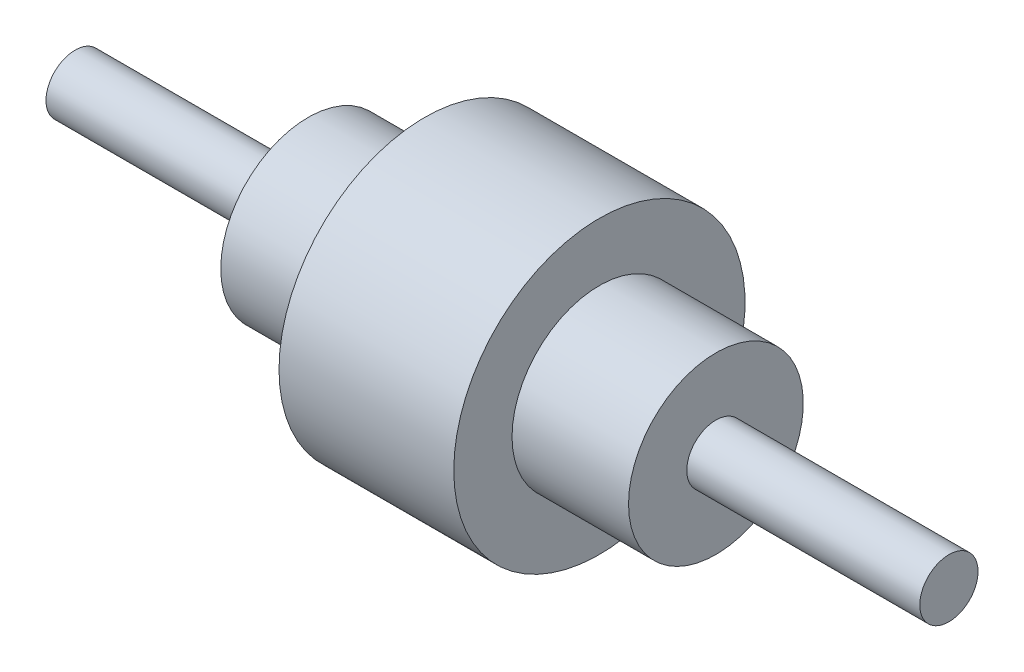
ISO-10303-21;
HEADER;
FILE_DESCRIPTION(('STEP AP214'),'2;1');
FILE_NAME('part.step','',(''),(''),'','','');
FILE_SCHEMA(('AUTOMOTIVE_DESIGN { 1 0 10303 214 1 1 1 1 }'));
ENDSEC;
DATA;
#1=APPLICATION_CONTEXT('core data for automotive mechanical design processes');
#2=APPLICATION_PROTOCOL_DEFINITION('international standard','automotive_design',2000,#1);
#3=PRODUCT_CONTEXT('',#1,'mechanical');
#4=PRODUCT('Part','Part','',(#3));
#5=PRODUCT_RELATED_PRODUCT_CATEGORY('part','',(#4));
#6=PRODUCT_DEFINITION_FORMATION('','',#4);
#7=PRODUCT_DEFINITION_CONTEXT('part definition',#1,'design');
#8=PRODUCT_DEFINITION('design','',#6,#7);
#9=PRODUCT_DEFINITION_SHAPE('','',#8);
#10=(LENGTH_UNIT() NAMED_UNIT(*) SI_UNIT(.MILLI.,.METRE.));
#11=(NAMED_UNIT(*) PLANE_ANGLE_UNIT() SI_UNIT($,.RADIAN.));
#12=(NAMED_UNIT(*) SI_UNIT($,.STERADIAN.) SOLID_ANGLE_UNIT());
#13=UNCERTAINTY_MEASURE_WITH_UNIT(LENGTH_MEASURE(1.E-05),#10,'distance_accuracy_value','');
#14=(GEOMETRIC_REPRESENTATION_CONTEXT(3) GLOBAL_UNCERTAINTY_ASSIGNED_CONTEXT((#13)) GLOBAL_UNIT_ASSIGNED_CONTEXT((#10,
#11,#12)) REPRESENTATION_CONTEXT('',''));
#15=CARTESIAN_POINT('',(0.,0.,0.));
#16=DIRECTION('',(0.,0.,1.));
#17=DIRECTION('',(1.,0.,0.));
#18=AXIS2_PLACEMENT_3D('',#15,#16,#17);
#19=CARTESIAN_POINT('',(300.,0.,0.));
#20=DIRECTION('',(1.,0.,0.));
#21=DIRECTION('',(0.,0.,-1.));
#22=AXIS2_PLACEMENT_3D('',#19,#20,#21);
#23=PLANE('',#22);
#24=CARTESIAN_POINT('',(300.,0.,0.));
#25=DIRECTION('',(-1.,0.,0.));
#26=DIRECTION('',(0.,0.,1.));
#27=AXIS2_PLACEMENT_3D('',#24,#25,#26);
#28=CIRCLE('',#27,9.99999999999996);
#29=CARTESIAN_POINT('',(300.,0.,9.99999999999996));
#30=VERTEX_POINT('',#29);
#31=EDGE_CURVE('E10',#30,#30,#28,.T.);
#32=ORIENTED_EDGE('',*,*,#31,.F.);
#33=EDGE_LOOP('',(#32));
#34=FACE_BOUND('',#33,.T.);
#35=ADVANCED_FACE('F31',(#34),#23,.T.);
#36=CARTESIAN_POINT('',(0.,0.,0.));
#37=DIRECTION('',(-1.,0.,0.));
#38=DIRECTION('',(0.,0.,1.));
#39=AXIS2_PLACEMENT_3D('',#36,#37,#38);
#40=CYLINDRICAL_SURFACE('',#39,9.99999999999997);
#41=ORIENTED_EDGE('',*,*,#31,.T.);
#42=EDGE_LOOP('',(#41));
#43=FACE_BOUND('',#42,.T.);
#44=CARTESIAN_POINT('',(220.,0.,0.));
#45=DIRECTION('',(-1.,0.,0.));
#46=DIRECTION('',(0.,0.,1.));
#47=AXIS2_PLACEMENT_3D('',#44,#45,#46);
#48=CIRCLE('',#47,9.99999999999997);
#49=CARTESIAN_POINT('',(220.,0.,9.99999999999997));
#50=VERTEX_POINT('',#49);
#51=EDGE_CURVE('E37',#50,#50,#48,.T.);
#52=ORIENTED_EDGE('',*,*,#51,.F.);
#53=EDGE_LOOP('',(#52));
#54=FACE_BOUND('',#53,.T.);
#55=ADVANCED_FACE('F85',(#43,#54),#40,.T.);
#56=CARTESIAN_POINT('',(220.,-9.99999999999997,0.));
#57=DIRECTION('',(1.,0.,0.));
#58=DIRECTION('',(0.,0.,-1.));
#59=AXIS2_PLACEMENT_3D('',#56,#57,#58);
#60=PLANE('',#59);
#61=ORIENTED_EDGE('',*,*,#51,.T.);
#62=EDGE_LOOP('',(#61));
#63=FACE_BOUND('',#62,.T.);
#64=CARTESIAN_POINT('',(220.,0.,0.));
#65=DIRECTION('',(-1.,0.,0.));
#66=DIRECTION('',(0.,0.,1.));
#67=AXIS2_PLACEMENT_3D('',#64,#65,#66);
#68=CIRCLE('',#67,30.);
#69=CARTESIAN_POINT('',(220.,0.,30.));
#70=VERTEX_POINT('',#69);
#71=EDGE_CURVE('E41',#70,#70,#68,.T.);
#72=ORIENTED_EDGE('',*,*,#71,.F.);
#73=EDGE_LOOP('',(#72));
#74=FACE_BOUND('',#73,.T.);
#75=ADVANCED_FACE('F90',(#63,#74),#60,.T.);
#76=CARTESIAN_POINT('',(0.,0.,0.));
#77=DIRECTION('',(-1.,0.,0.));
#78=DIRECTION('',(0.,0.,1.));
#79=AXIS2_PLACEMENT_3D('',#76,#77,#78);
#80=CYLINDRICAL_SURFACE('',#79,30.);
#81=ORIENTED_EDGE('',*,*,#71,.T.);
#82=EDGE_LOOP('',(#81));
#83=FACE_BOUND('',#82,.T.);
#84=CARTESIAN_POINT('',(180.,0.,0.));
#85=DIRECTION('',(-1.,0.,0.));
#86=DIRECTION('',(0.,0.,1.));
#87=AXIS2_PLACEMENT_3D('',#84,#85,#86);
#88=CIRCLE('',#87,30.);
#89=CARTESIAN_POINT('',(180.,0.,30.));
#90=VERTEX_POINT('',#89);
#91=EDGE_CURVE('E45',#90,#90,#88,.T.);
#92=ORIENTED_EDGE('',*,*,#91,.F.);
#93=EDGE_LOOP('',(#92));
#94=FACE_BOUND('',#93,.T.);
#95=ADVANCED_FACE('F94',(#83,#94),#80,.T.);
#96=CARTESIAN_POINT('',(180.,-30.,0.));
#97=DIRECTION('',(1.,0.,0.));
#98=DIRECTION('',(0.,0.,-1.));
#99=AXIS2_PLACEMENT_3D('',#96,#97,#98);
#100=PLANE('',#99);
#101=ORIENTED_EDGE('',*,*,#91,.T.);
#102=EDGE_LOOP('',(#101));
#103=FACE_BOUND('',#102,.T.);
#104=CARTESIAN_POINT('',(180.,0.,0.));
#105=DIRECTION('',(-1.,0.,0.));
#106=DIRECTION('',(0.,0.,1.));
#107=AXIS2_PLACEMENT_3D('',#104,#105,#106);
#108=CIRCLE('',#107,50.);
#109=CARTESIAN_POINT('',(180.,0.,50.));
#110=VERTEX_POINT('',#109);
#111=EDGE_CURVE('E50',#110,#110,#108,.T.);
#112=ORIENTED_EDGE('',*,*,#111,.F.);
#113=EDGE_LOOP('',(#112));
#114=FACE_BOUND('',#113,.T.);
#115=ADVANCED_FACE('F100',(#103,#114),#100,.T.);
#116=CARTESIAN_POINT('',(0.,0.,0.));
#117=DIRECTION('',(-1.,0.,0.));
#118=DIRECTION('',(0.,0.,1.));
#119=AXIS2_PLACEMENT_3D('',#116,#117,#118);
#120=CYLINDRICAL_SURFACE('',#119,50.);
#121=ORIENTED_EDGE('',*,*,#111,.T.);
#122=EDGE_LOOP('',(#121));
#123=FACE_BOUND('',#122,.T.);
#124=CARTESIAN_POINT('',(120.,0.,0.));
#125=DIRECTION('',(-1.,0.,0.));
#126=DIRECTION('',(0.,0.,1.));
#127=AXIS2_PLACEMENT_3D('',#124,#125,#126);
#128=CIRCLE('',#127,50.);
#129=CARTESIAN_POINT('',(120.,0.,50.));
#130=VERTEX_POINT('',#129);
#131=EDGE_CURVE('E53',#130,#130,#128,.T.);
#132=ORIENTED_EDGE('',*,*,#131,.F.);
#133=EDGE_LOOP('',(#132));
#134=FACE_BOUND('',#133,.T.);
#135=ADVANCED_FACE('F104',(#123,#134),#120,.T.);
#136=CARTESIAN_POINT('',(120.,-50.,0.));
#137=DIRECTION('',(-1.,0.,0.));
#138=DIRECTION('',(0.,0.,1.));
#139=AXIS2_PLACEMENT_3D('',#136,#137,#138);
#140=PLANE('',#139);
#141=ORIENTED_EDGE('',*,*,#131,.T.);
#142=EDGE_LOOP('',(#141));
#143=FACE_BOUND('',#142,.T.);
#144=CARTESIAN_POINT('',(120.,0.,0.));
#145=DIRECTION('',(-1.,0.,0.));
#146=DIRECTION('',(0.,0.,1.));
#147=AXIS2_PLACEMENT_3D('',#144,#145,#146);
#148=CIRCLE('',#147,30.);
#149=CARTESIAN_POINT('',(120.,0.,30.));
#150=VERTEX_POINT('',#149);
#151=EDGE_CURVE('E56',#150,#150,#148,.T.);
#152=ORIENTED_EDGE('',*,*,#151,.F.);
#153=EDGE_LOOP('',(#152));
#154=FACE_BOUND('',#153,.T.);
#155=ADVANCED_FACE('F108',(#143,#154),#140,.T.);
#156=CARTESIAN_POINT('',(0.,0.,0.));
#157=DIRECTION('',(-1.,0.,0.));
#158=DIRECTION('',(0.,0.,1.));
#159=AXIS2_PLACEMENT_3D('',#156,#157,#158);
#160=CYLINDRICAL_SURFACE('',#159,30.);
#161=ORIENTED_EDGE('',*,*,#151,.T.);
#162=EDGE_LOOP('',(#161));
#163=FACE_BOUND('',#162,.T.);
#164=CARTESIAN_POINT('',(80.,0.,0.));
#165=DIRECTION('',(-1.,0.,0.));
#166=DIRECTION('',(0.,0.,1.));
#167=AXIS2_PLACEMENT_3D('',#164,#165,#166);
#168=CIRCLE('',#167,30.);
#169=CARTESIAN_POINT('',(80.,0.,30.));
#170=VERTEX_POINT('',#169);
#171=EDGE_CURVE('E59',#170,#170,#168,.T.);
#172=ORIENTED_EDGE('',*,*,#171,.F.);
#173=EDGE_LOOP('',(#172));
#174=FACE_BOUND('',#173,.T.);
#175=ADVANCED_FACE('F81',(#163,#174),#160,.T.);
#176=CARTESIAN_POINT('',(80.,-30.,0.));
#177=DIRECTION('',(-1.,0.,0.));
#178=DIRECTION('',(0.,0.,1.));
#179=AXIS2_PLACEMENT_3D('',#176,#177,#178);
#180=PLANE('',#179);
#181=ORIENTED_EDGE('',*,*,#171,.T.);
#182=EDGE_LOOP('',(#181));
#183=FACE_BOUND('',#182,.T.);
#184=CARTESIAN_POINT('',(80.,0.,0.));
#185=DIRECTION('',(-1.,0.,0.));
#186=DIRECTION('',(0.,0.,1.));
#187=AXIS2_PLACEMENT_3D('',#184,#185,#186);
#188=CIRCLE('',#187,9.99999999999999);
#189=CARTESIAN_POINT('',(80.,0.,9.99999999999999));
#190=VERTEX_POINT('',#189);
#191=EDGE_CURVE('E62',#190,#190,#188,.T.);
#192=ORIENTED_EDGE('',*,*,#191,.F.);
#193=EDGE_LOOP('',(#192));
#194=FACE_BOUND('',#193,.T.);
#195=ADVANCED_FACE('F73',(#183,#194),#180,.T.);
#196=CARTESIAN_POINT('',(0.,0.,0.));
#197=DIRECTION('',(-1.,0.,0.));
#198=DIRECTION('',(0.,0.,1.));
#199=AXIS2_PLACEMENT_3D('',#196,#197,#198);
#200=CYLINDRICAL_SURFACE('',#199,9.99999999999999);
#201=ORIENTED_EDGE('',*,*,#191,.T.);
#202=EDGE_LOOP('',(#201));
#203=FACE_BOUND('',#202,.T.);
#204=CARTESIAN_POINT('',(0.,0.,0.));
#205=DIRECTION('',(-1.,0.,0.));
#206=DIRECTION('',(0.,0.,1.));
#207=AXIS2_PLACEMENT_3D('',#204,#205,#206);
#208=CIRCLE('',#207,10.);
#209=CARTESIAN_POINT('',(0.,0.,10.));
#210=VERTEX_POINT('',#209);
#211=EDGE_CURVE('E65',#210,#210,#208,.T.);
#212=ORIENTED_EDGE('',*,*,#211,.F.);
#213=EDGE_LOOP('',(#212));
#214=FACE_BOUND('',#213,.T.);
#215=ADVANCED_FACE('F71',(#203,#214),#200,.T.);
#216=CARTESIAN_POINT('',(0.,-10.,0.));
#217=DIRECTION('',(-1.,0.,0.));
#218=DIRECTION('',(0.,0.,1.));
#219=AXIS2_PLACEMENT_3D('',#216,#217,#218);
#220=PLANE('',#219);
#221=ORIENTED_EDGE('',*,*,#211,.T.);
#222=EDGE_LOOP('',(#221));
#223=FACE_BOUND('',#222,.T.);
#224=ADVANCED_FACE('F69',(#223),#220,.T.);
#225=CLOSED_SHELL('',(#35,#55,#75,#95,#115,#135,#155,#175,#195,#215,#224));
#226=MANIFOLD_SOLID_BREP('B2',#225);
#227=ADVANCED_BREP_SHAPE_REPRESENTATION('',(#18,#226),#14);
#228=SHAPE_DEFINITION_REPRESENTATION(#9,#227);
ENDSEC;
END-ISO-10303-21;
